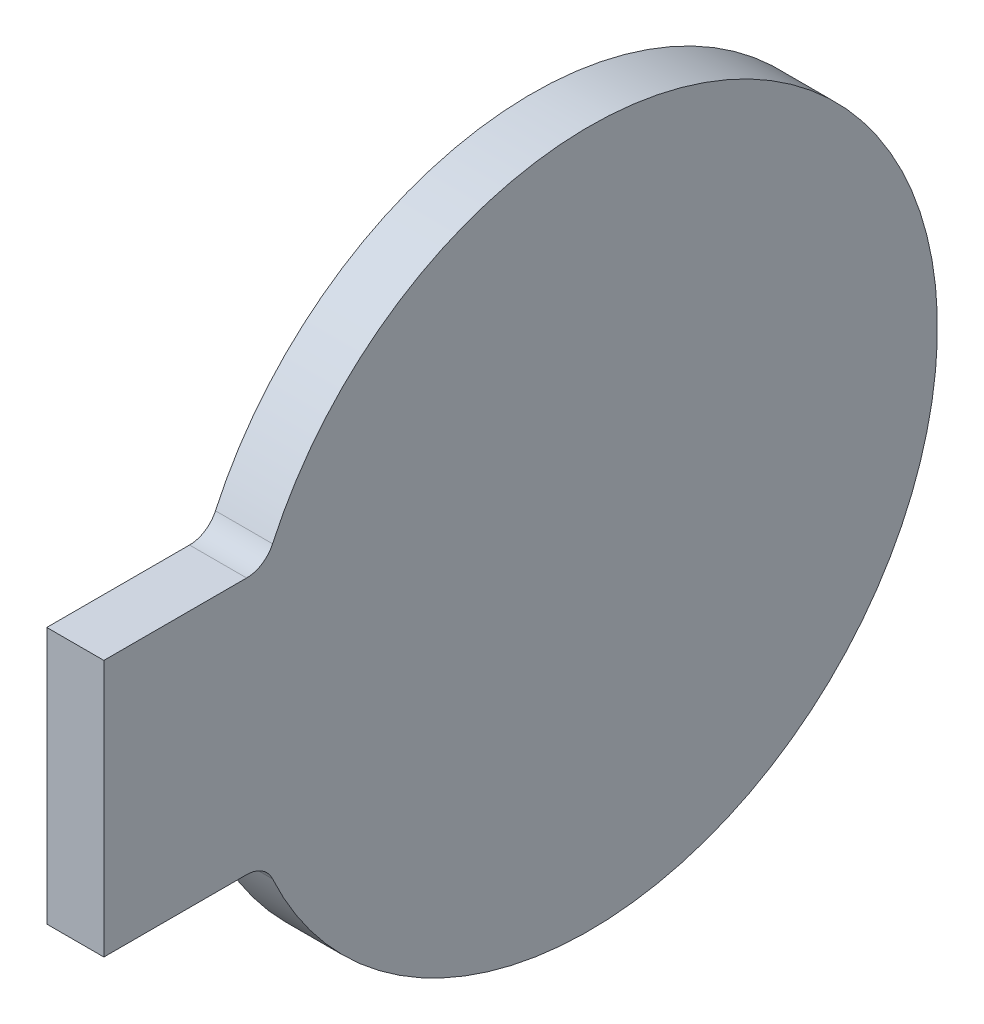
ISO-10303-21;
HEADER;
FILE_DESCRIPTION(('STEP AP214'),'2;1');
FILE_NAME('part.step','',(''),(''),'','','');
FILE_SCHEMA(('AUTOMOTIVE_DESIGN { 1 0 10303 214 1 1 1 1 }'));
ENDSEC;
DATA;
#1=APPLICATION_CONTEXT('core data for automotive mechanical design processes');
#2=APPLICATION_PROTOCOL_DEFINITION('international standard','automotive_design',2000,#1);
#3=PRODUCT_CONTEXT('',#1,'mechanical');
#4=PRODUCT('Part','Part','',(#3));
#5=PRODUCT_RELATED_PRODUCT_CATEGORY('part','',(#4));
#6=PRODUCT_DEFINITION_FORMATION('','',#4);
#7=PRODUCT_DEFINITION_CONTEXT('part definition',#1,'design');
#8=PRODUCT_DEFINITION('design','',#6,#7);
#9=PRODUCT_DEFINITION_SHAPE('','',#8);
#10=(LENGTH_UNIT() NAMED_UNIT(*) SI_UNIT(.MILLI.,.METRE.));
#11=(NAMED_UNIT(*) PLANE_ANGLE_UNIT() SI_UNIT($,.RADIAN.));
#12=(NAMED_UNIT(*) SI_UNIT($,.STERADIAN.) SOLID_ANGLE_UNIT());
#13=UNCERTAINTY_MEASURE_WITH_UNIT(LENGTH_MEASURE(1.E-05),#10,'distance_accuracy_value','');
#14=(GEOMETRIC_REPRESENTATION_CONTEXT(3) GLOBAL_UNCERTAINTY_ASSIGNED_CONTEXT((#13)) GLOBAL_UNIT_ASSIGNED_CONTEXT((#10,
#11,#12)) REPRESENTATION_CONTEXT('',''));
#15=CARTESIAN_POINT('',(0.,0.,0.));
#16=DIRECTION('',(0.,0.,1.));
#17=DIRECTION('',(1.,0.,0.));
#18=AXIS2_PLACEMENT_3D('',#15,#16,#17);
#19=CARTESIAN_POINT('',(0.,0.,0.));
#20=DIRECTION('',(1.,0.,0.));
#21=DIRECTION('',(0.,0.,-1.));
#22=AXIS2_PLACEMENT_3D('',#19,#20,#21);
#23=CYLINDRICAL_SURFACE('',#22,12.2);
#24=CARTESIAN_POINT('',(0.,0.,0.));
#25=DIRECTION('',(1.,0.,0.));
#26=DIRECTION('',(0.,0.,-1.));
#27=AXIS2_PLACEMENT_3D('',#24,#25,#26);
#28=CIRCLE('',#27,12.2);
#29=CARTESIAN_POINT('',(0.,-5.08333333333333,11.090523983213));
#30=VERTEX_POINT('',#29);
#31=CARTESIAN_POINT('',(0.,5.08333333333333,11.090523983213));
#32=VERTEX_POINT('',#31);
#33=EDGE_CURVE('E111',#30,#32,#28,.T.);
#34=ORIENTED_EDGE('',*,*,#33,.F.);
#35=DIRECTION('',(1.,0.,0.));
#36=VECTOR('',#35,1.);
#37=CARTESIAN_POINT('',(0.,-5.08333333333333,11.090523983213));
#38=LINE('',#37,#36);
#39=CARTESIAN_POINT('',(-2.,-5.08333333333333,11.090523983213));
#40=VERTEX_POINT('',#39);
#41=EDGE_CURVE('E121',#30,#40,#38,.F.);
#42=ORIENTED_EDGE('',*,*,#41,.T.);
#43=CARTESIAN_POINT('',(-2.,0.,0.));
#44=DIRECTION('',(1.,0.,0.));
#45=DIRECTION('',(0.,0.,-1.));
#46=AXIS2_PLACEMENT_3D('',#43,#44,#45);
#47=CIRCLE('',#46,12.2);
#48=CARTESIAN_POINT('',(-2.,5.08333333333333,11.090523983213));
#49=VERTEX_POINT('',#48);
#50=EDGE_CURVE('E108',#40,#49,#47,.T.);
#51=ORIENTED_EDGE('',*,*,#50,.T.);
#52=DIRECTION('',(1.,0.,0.));
#53=VECTOR('',#52,1.);
#54=CARTESIAN_POINT('',(0.,5.08333333333333,11.090523983213));
#55=LINE('',#54,#53);
#56=EDGE_CURVE('E119',#49,#32,#55,.T.);
#57=ORIENTED_EDGE('',*,*,#56,.T.);
#58=EDGE_LOOP('',(#34,#42,#51,#57));
#59=FACE_BOUND('',#58,.T.);
#60=ADVANCED_FACE('F34',(#59),#23,.T.);
#61=CARTESIAN_POINT('',(0.,0.,0.));
#62=DIRECTION('',(-1.,0.,0.));
#63=DIRECTION('',(0.,0.,1.));
#64=AXIS2_PLACEMENT_3D('',#61,#62,#63);
#65=PLANE('',#64);
#66=DIRECTION('',(0.,0.,-1.));
#67=VECTOR('',#66,1.);
#68=CARTESIAN_POINT('',(0.,-4.5,17.));
#69=LINE('',#68,#67);
#70=CARTESIAN_POINT('',(0.,-4.5,17.));
#71=VERTEX_POINT('',#70);
#72=CARTESIAN_POINT('',(0.,-4.5,11.9995833260993));
#73=VERTEX_POINT('',#72);
#74=EDGE_CURVE('E89',#71,#73,#69,.T.);
#75=ORIENTED_EDGE('',*,*,#74,.T.);
#76=CARTESIAN_POINT('',(0.,-5.5,11.9995833260993));
#77=DIRECTION('',(-1.,0.,0.));
#78=DIRECTION('',(0.,0.,1.));
#79=AXIS2_PLACEMENT_3D('',#76,#77,#78);
#80=CIRCLE('',#79,1.);
#81=EDGE_CURVE('E125',#73,#30,#80,.T.);
#82=ORIENTED_EDGE('',*,*,#81,.T.);
#83=ORIENTED_EDGE('',*,*,#33,.T.);
#84=CARTESIAN_POINT('',(0.,5.5,11.9995833260993));
#85=DIRECTION('',(-1.,0.,0.));
#86=DIRECTION('',(0.,0.,1.));
#87=AXIS2_PLACEMENT_3D('',#84,#85,#86);
#88=CIRCLE('',#87,1.);
#89=CARTESIAN_POINT('',(0.,4.5,11.9995833260993));
#90=VERTEX_POINT('',#89);
#91=EDGE_CURVE('E11',#32,#90,#88,.T.);
#92=ORIENTED_EDGE('',*,*,#91,.T.);
#93=DIRECTION('',(0.,0.,-1.));
#94=VECTOR('',#93,1.);
#95=CARTESIAN_POINT('',(0.,4.5,17.));
#96=LINE('',#95,#94);
#97=CARTESIAN_POINT('',(0.,4.5,17.));
#98=VERTEX_POINT('',#97);
#99=EDGE_CURVE('E90',#98,#90,#96,.T.);
#100=ORIENTED_EDGE('',*,*,#99,.F.);
#101=DIRECTION('',(0.,1.,0.));
#102=VECTOR('',#101,1.);
#103=CARTESIAN_POINT('',(0.,-4.5,17.));
#104=LINE('',#103,#102);
#105=EDGE_CURVE('E85',#71,#98,#104,.T.);
#106=ORIENTED_EDGE('',*,*,#105,.F.);
#107=EDGE_LOOP('',(#75,#82,#83,#92,#100,#106));
#108=FACE_BOUND('',#107,.T.);
#109=ADVANCED_FACE('F87',(#108),#65,.F.);
#110=CARTESIAN_POINT('',(-2.,0.,0.));
#111=DIRECTION('',(1.,0.,0.));
#112=DIRECTION('',(0.,0.,-1.));
#113=AXIS2_PLACEMENT_3D('',#110,#111,#112);
#114=PLANE('',#113);
#115=ORIENTED_EDGE('',*,*,#50,.F.);
#116=CARTESIAN_POINT('',(-2.,-5.5,11.9995833260993));
#117=DIRECTION('',(1.,0.,0.));
#118=DIRECTION('',(0.,0.,-1.));
#119=AXIS2_PLACEMENT_3D('',#116,#117,#118);
#120=CIRCLE('',#119,1.);
#121=CARTESIAN_POINT('',(-2.,-4.5,11.9995833260993));
#122=VERTEX_POINT('',#121);
#123=EDGE_CURVE('E127',#40,#122,#120,.T.);
#124=ORIENTED_EDGE('',*,*,#123,.T.);
#125=DIRECTION('',(0.,0.,-1.));
#126=VECTOR('',#125,1.);
#127=CARTESIAN_POINT('',(-2.,-4.5,17.));
#128=LINE('',#127,#126);
#129=CARTESIAN_POINT('',(-2.,-4.5,17.));
#130=VERTEX_POINT('',#129);
#131=EDGE_CURVE('E140',#130,#122,#128,.T.);
#132=ORIENTED_EDGE('',*,*,#131,.F.);
#133=DIRECTION('',(0.,-1.,0.));
#134=VECTOR('',#133,1.);
#135=CARTESIAN_POINT('',(-2.,4.5,17.));
#136=LINE('',#135,#134);
#137=CARTESIAN_POINT('',(-2.,4.5,17.));
#138=VERTEX_POINT('',#137);
#139=EDGE_CURVE('E99',#138,#130,#136,.T.);
#140=ORIENTED_EDGE('',*,*,#139,.F.);
#141=DIRECTION('',(0.,0.,-1.));
#142=VECTOR('',#141,1.);
#143=CARTESIAN_POINT('',(-2.,4.5,17.));
#144=LINE('',#143,#142);
#145=CARTESIAN_POINT('',(-2.,4.5,11.9995833260993));
#146=VERTEX_POINT('',#145);
#147=EDGE_CURVE('E113',#138,#146,#144,.T.);
#148=ORIENTED_EDGE('',*,*,#147,.T.);
#149=CARTESIAN_POINT('',(-2.,5.5,11.9995833260993));
#150=DIRECTION('',(1.,0.,0.));
#151=DIRECTION('',(0.,0.,-1.));
#152=AXIS2_PLACEMENT_3D('',#149,#150,#151);
#153=CIRCLE('',#152,1.);
#154=EDGE_CURVE('E42',#146,#49,#153,.T.);
#155=ORIENTED_EDGE('',*,*,#154,.T.);
#156=EDGE_LOOP('',(#115,#124,#132,#140,#148,#155));
#157=FACE_BOUND('',#156,.T.);
#158=ADVANCED_FACE('F131',(#157),#114,.F.);
#159=CARTESIAN_POINT('',(-2.,-4.5,17.));
#160=DIRECTION('',(0.,1.,0.));
#161=DIRECTION('',(0.,0.,1.));
#162=AXIS2_PLACEMENT_3D('',#159,#160,#161);
#163=PLANE('',#162);
#164=ORIENTED_EDGE('',*,*,#131,.T.);
#165=DIRECTION('',(-1.,0.,0.));
#166=VECTOR('',#165,1.);
#167=CARTESIAN_POINT('',(0.,-4.5,11.9995833260993));
#168=LINE('',#167,#166);
#169=EDGE_CURVE('E107',#122,#73,#168,.F.);
#170=ORIENTED_EDGE('',*,*,#169,.T.);
#171=ORIENTED_EDGE('',*,*,#74,.F.);
#172=DIRECTION('',(1.,0.,0.));
#173=VECTOR('',#172,1.);
#174=CARTESIAN_POINT('',(-2.,-4.5,17.));
#175=LINE('',#174,#173);
#176=EDGE_CURVE('E94',#130,#71,#175,.T.);
#177=ORIENTED_EDGE('',*,*,#176,.F.);
#178=EDGE_LOOP('',(#164,#170,#171,#177));
#179=FACE_BOUND('',#178,.T.);
#180=ADVANCED_FACE('F105',(#179),#163,.F.);
#181=CARTESIAN_POINT('',(-2.,4.5,17.));
#182=DIRECTION('',(0.,-1.,0.));
#183=DIRECTION('',(0.,0.,-1.));
#184=AXIS2_PLACEMENT_3D('',#181,#182,#183);
#185=PLANE('',#184);
#186=ORIENTED_EDGE('',*,*,#99,.T.);
#187=DIRECTION('',(-1.,0.,0.));
#188=VECTOR('',#187,1.);
#189=CARTESIAN_POINT('',(-2.,4.5,11.9995833260993));
#190=LINE('',#189,#188);
#191=EDGE_CURVE('E123',#90,#146,#190,.T.);
#192=ORIENTED_EDGE('',*,*,#191,.T.);
#193=ORIENTED_EDGE('',*,*,#147,.F.);
#194=DIRECTION('',(-1.,0.,0.));
#195=VECTOR('',#194,1.);
#196=CARTESIAN_POINT('',(-2.,4.5,17.));
#197=LINE('',#196,#195);
#198=EDGE_CURVE('E93',#98,#138,#197,.T.);
#199=ORIENTED_EDGE('',*,*,#198,.F.);
#200=EDGE_LOOP('',(#186,#192,#193,#199));
#201=FACE_BOUND('',#200,.T.);
#202=ADVANCED_FACE('F138',(#201),#185,.F.);
#203=CARTESIAN_POINT('',(0.,0.,17.));
#204=DIRECTION('',(0.,0.,1.));
#205=DIRECTION('',(1.,0.,0.));
#206=AXIS2_PLACEMENT_3D('',#203,#204,#205);
#207=PLANE('',#206);
#208=ORIENTED_EDGE('',*,*,#176,.T.);
#209=ORIENTED_EDGE('',*,*,#105,.T.);
#210=ORIENTED_EDGE('',*,*,#198,.T.);
#211=ORIENTED_EDGE('',*,*,#139,.T.);
#212=EDGE_LOOP('',(#208,#209,#210,#211));
#213=FACE_BOUND('',#212,.T.);
#214=ADVANCED_FACE('F97',(#213),#207,.T.);
#215=CARTESIAN_POINT('',(0.,-5.5,11.9995833260993));
#216=DIRECTION('',(1.,0.,0.));
#217=DIRECTION('',(0.,0.,-1.));
#218=AXIS2_PLACEMENT_3D('',#215,#216,#217);
#219=CYLINDRICAL_SURFACE('',#218,1.);
#220=ORIENTED_EDGE('',*,*,#123,.F.);
#221=ORIENTED_EDGE('',*,*,#41,.F.);
#222=ORIENTED_EDGE('',*,*,#81,.F.);
#223=ORIENTED_EDGE('',*,*,#169,.F.);
#224=EDGE_LOOP('',(#220,#221,#222,#223));
#225=FACE_BOUND('',#224,.T.);
#226=ADVANCED_FACE('F144',(#225),#219,.F.);
#227=CARTESIAN_POINT('',(0.,5.5,11.9995833260993));
#228=DIRECTION('',(1.,0.,0.));
#229=DIRECTION('',(0.,0.,-1.));
#230=AXIS2_PLACEMENT_3D('',#227,#228,#229);
#231=CYLINDRICAL_SURFACE('',#230,1.);
#232=ORIENTED_EDGE('',*,*,#91,.F.);
#233=ORIENTED_EDGE('',*,*,#56,.F.);
#234=ORIENTED_EDGE('',*,*,#154,.F.);
#235=ORIENTED_EDGE('',*,*,#191,.F.);
#236=EDGE_LOOP('',(#232,#233,#234,#235));
#237=FACE_BOUND('',#236,.T.);
#238=ADVANCED_FACE('F36',(#237),#231,.F.);
#239=CLOSED_SHELL('',(#60,#109,#158,#180,#202,#214,#226,#238));
#240=MANIFOLD_SOLID_BREP('B2',#239);
#241=ADVANCED_BREP_SHAPE_REPRESENTATION('',(#18,#240),#14);
#242=SHAPE_DEFINITION_REPRESENTATION(#9,#241);
ENDSEC;
END-ISO-10303-21;
